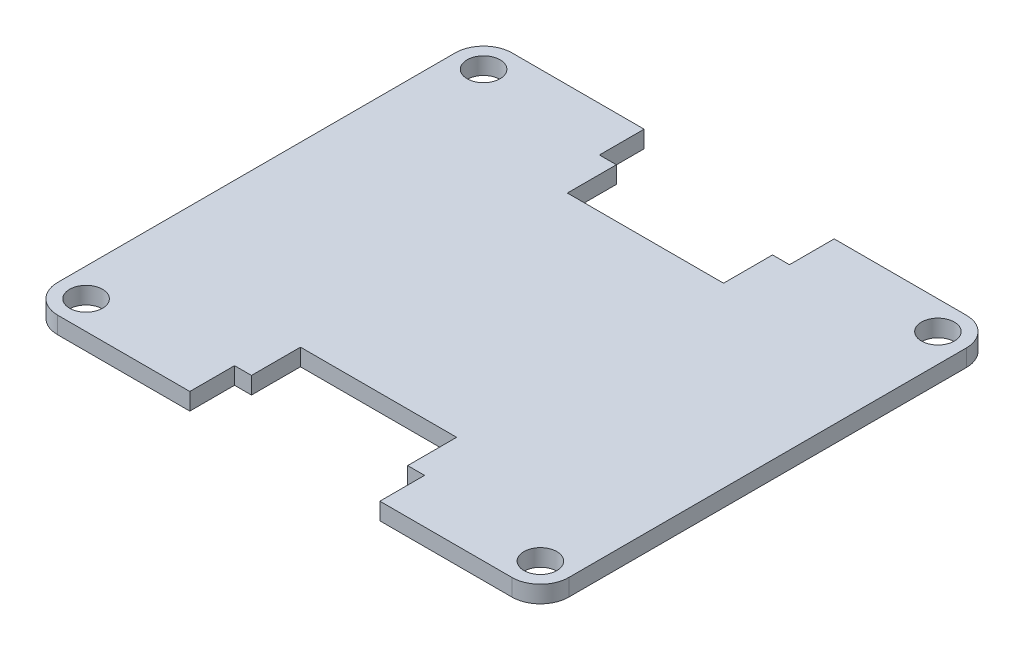
ISO-10303-21;
HEADER;
FILE_DESCRIPTION(('STEP AP214'),'2;1');
FILE_NAME('part.step','',(''),(''),'','','');
FILE_SCHEMA(('AUTOMOTIVE_DESIGN { 1 0 10303 214 1 1 1 1 }'));
ENDSEC;
DATA;
#1=APPLICATION_CONTEXT('core data for automotive mechanical design processes');
#2=APPLICATION_PROTOCOL_DEFINITION('international standard','automotive_design',2000,#1);
#3=PRODUCT_CONTEXT('',#1,'mechanical');
#4=PRODUCT('Part','Part','',(#3));
#5=PRODUCT_RELATED_PRODUCT_CATEGORY('part','',(#4));
#6=PRODUCT_DEFINITION_FORMATION('','',#4);
#7=PRODUCT_DEFINITION_CONTEXT('part definition',#1,'design');
#8=PRODUCT_DEFINITION('design','',#6,#7);
#9=PRODUCT_DEFINITION_SHAPE('','',#8);
#10=(LENGTH_UNIT() NAMED_UNIT(*) SI_UNIT(.MILLI.,.METRE.));
#11=(NAMED_UNIT(*) PLANE_ANGLE_UNIT() SI_UNIT($,.RADIAN.));
#12=(NAMED_UNIT(*) SI_UNIT($,.STERADIAN.) SOLID_ANGLE_UNIT());
#13=UNCERTAINTY_MEASURE_WITH_UNIT(LENGTH_MEASURE(1.E-05),#10,'distance_accuracy_value','');
#14=(GEOMETRIC_REPRESENTATION_CONTEXT(3) GLOBAL_UNCERTAINTY_ASSIGNED_CONTEXT((#13)) GLOBAL_UNIT_ASSIGNED_CONTEXT((#10,
#11,#12)) REPRESENTATION_CONTEXT('',''));
#15=CARTESIAN_POINT('',(0.,0.,0.));
#16=DIRECTION('',(0.,0.,1.));
#17=DIRECTION('',(1.,0.,0.));
#18=AXIS2_PLACEMENT_3D('',#15,#16,#17);
#19=CARTESIAN_POINT('',(-22.86,0.762,20.32));
#20=DIRECTION('',(0.,0.,-1.));
#21=DIRECTION('',(-1.,0.,0.));
#22=AXIS2_PLACEMENT_3D('',#19,#20,#21);
#23=PLANE('',#22);
#24=DIRECTION('',(0.,1.,0.));
#25=VECTOR('',#24,1.);
#26=CARTESIAN_POINT('',(8.5,-0.762,20.32));
#27=LINE('',#26,#25);
#28=CARTESIAN_POINT('',(8.5,-0.762,20.32));
#29=VERTEX_POINT('',#28);
#30=CARTESIAN_POINT('',(8.5,0.762,20.32));
#31=VERTEX_POINT('',#30);
#32=EDGE_CURVE('E277',#29,#31,#27,.T.);
#33=ORIENTED_EDGE('',*,*,#32,.F.);
#34=DIRECTION('',(1.,0.,0.));
#35=VECTOR('',#34,1.);
#36=CARTESIAN_POINT('',(-22.86,-0.762,20.32));
#37=LINE('',#36,#35);
#38=CARTESIAN_POINT('',(20.32,-0.762,20.32));
#39=VERTEX_POINT('',#38);
#40=EDGE_CURVE('E428',#29,#39,#37,.T.);
#41=ORIENTED_EDGE('',*,*,#40,.T.);
#42=DIRECTION('',(0.,-1.,0.));
#43=VECTOR('',#42,1.);
#44=CARTESIAN_POINT('',(20.32,0.762,20.32));
#45=LINE('',#44,#43);
#46=CARTESIAN_POINT('',(20.32,0.762,20.32));
#47=VERTEX_POINT('',#46);
#48=EDGE_CURVE('E11',#39,#47,#45,.F.);
#49=ORIENTED_EDGE('',*,*,#48,.T.);
#50=DIRECTION('',(1.,0.,0.));
#51=VECTOR('',#50,1.);
#52=CARTESIAN_POINT('',(-22.86,0.762,20.32));
#53=LINE('',#52,#51);
#54=EDGE_CURVE('E410',#31,#47,#53,.T.);
#55=ORIENTED_EDGE('',*,*,#54,.F.);
#56=EDGE_LOOP('',(#33,#41,#49,#55));
#57=FACE_BOUND('',#56,.T.);
#58=ADVANCED_FACE('F38',(#57),#23,.F.);
#59=DIRECTION('',(0.,1.,0.));
#60=VECTOR('',#59,1.);
#61=CARTESIAN_POINT('',(-8.5,-0.762,20.32));
#62=LINE('',#61,#60);
#63=CARTESIAN_POINT('',(-8.5,-0.762,20.32));
#64=VERTEX_POINT('',#63);
#65=CARTESIAN_POINT('',(-8.5,0.762,20.32));
#66=VERTEX_POINT('',#65);
#67=EDGE_CURVE('E280',#64,#66,#62,.T.);
#68=ORIENTED_EDGE('',*,*,#67,.T.);
#69=CARTESIAN_POINT('',(-20.32,0.762,20.32));
#70=VERTEX_POINT('',#69);
#71=EDGE_CURVE('E411',#70,#66,#53,.T.);
#72=ORIENTED_EDGE('',*,*,#71,.F.);
#73=DIRECTION('',(0.,-1.,0.));
#74=VECTOR('',#73,1.);
#75=CARTESIAN_POINT('',(-20.32,0.762,20.32));
#76=LINE('',#75,#74);
#77=CARTESIAN_POINT('',(-20.32,-0.762,20.32));
#78=VERTEX_POINT('',#77);
#79=EDGE_CURVE('E47',#70,#78,#76,.T.);
#80=ORIENTED_EDGE('',*,*,#79,.T.);
#81=EDGE_CURVE('E401',#78,#64,#37,.T.);
#82=ORIENTED_EDGE('',*,*,#81,.T.);
#83=EDGE_LOOP('',(#68,#72,#80,#82));
#84=FACE_BOUND('',#83,.T.);
#85=ADVANCED_FACE('F484',(#84),#23,.F.);
#86=CARTESIAN_POINT('',(0.,0.762,0.));
#87=DIRECTION('',(0.,1.,0.));
#88=DIRECTION('',(0.,0.,1.));
#89=AXIS2_PLACEMENT_3D('',#86,#87,#88);
#90=PLANE('',#89);
#91=CARTESIAN_POINT('',(20.32,0.762,-17.78));
#92=DIRECTION('',(0.,1.,0.));
#93=DIRECTION('',(0.,0.,1.));
#94=AXIS2_PLACEMENT_3D('',#91,#92,#93);
#95=CIRCLE('',#94,1.4732);
#96=CARTESIAN_POINT('',(20.32,0.762,-16.3068));
#97=VERTEX_POINT('',#96);
#98=EDGE_CURVE('E342',#97,#97,#95,.T.);
#99=ORIENTED_EDGE('',*,*,#98,.F.);
#100=EDGE_LOOP('',(#99));
#101=FACE_BOUND('',#100,.T.);
#102=CARTESIAN_POINT('',(-20.32,0.762,17.78));
#103=DIRECTION('',(0.,1.,0.));
#104=DIRECTION('',(0.,0.,1.));
#105=AXIS2_PLACEMENT_3D('',#102,#103,#104);
#106=CIRCLE('',#105,1.4732);
#107=CARTESIAN_POINT('',(-20.32,0.762,19.2532));
#108=VERTEX_POINT('',#107);
#109=EDGE_CURVE('E371',#108,#108,#106,.T.);
#110=ORIENTED_EDGE('',*,*,#109,.F.);
#111=EDGE_LOOP('',(#110));
#112=FACE_BOUND('',#111,.T.);
#113=CARTESIAN_POINT('',(-20.32,0.762,-17.78));
#114=DIRECTION('',(0.,1.,0.));
#115=DIRECTION('',(0.,0.,1.));
#116=AXIS2_PLACEMENT_3D('',#113,#114,#115);
#117=CIRCLE('',#116,1.4732);
#118=CARTESIAN_POINT('',(-20.32,0.762,-16.3068));
#119=VERTEX_POINT('',#118);
#120=EDGE_CURVE('E379',#119,#119,#117,.T.);
#121=ORIENTED_EDGE('',*,*,#120,.F.);
#122=EDGE_LOOP('',(#121));
#123=FACE_BOUND('',#122,.T.);
#124=CARTESIAN_POINT('',(20.32,0.762,17.78));
#125=DIRECTION('',(0.,1.,0.));
#126=DIRECTION('',(0.,0.,1.));
#127=AXIS2_PLACEMENT_3D('',#124,#125,#126);
#128=CIRCLE('',#127,1.4732);
#129=CARTESIAN_POINT('',(20.32,0.762,19.2532));
#130=VERTEX_POINT('',#129);
#131=EDGE_CURVE('E387',#130,#130,#128,.T.);
#132=ORIENTED_EDGE('',*,*,#131,.F.);
#133=EDGE_LOOP('',(#132));
#134=FACE_BOUND('',#133,.T.);
#135=DIRECTION('',(1.,0.,0.));
#136=VECTOR('',#135,1.);
#137=CARTESIAN_POINT('',(0.,0.762,16.32));
#138=LINE('',#137,#136);
#139=CARTESIAN_POINT('',(6.985,0.762,16.32));
#140=VERTEX_POINT('',#139);
#141=CARTESIAN_POINT('',(8.5,0.762,16.32));
#142=VERTEX_POINT('',#141);
#143=EDGE_CURVE('E231',#140,#142,#138,.T.);
#144=ORIENTED_EDGE('',*,*,#143,.T.);
#145=DIRECTION('',(0.,0.,1.));
#146=VECTOR('',#145,1.);
#147=CARTESIAN_POINT('',(8.5,0.762,0.));
#148=LINE('',#147,#146);
#149=EDGE_CURVE('E260',#142,#31,#148,.T.);
#150=ORIENTED_EDGE('',*,*,#149,.T.);
#151=ORIENTED_EDGE('',*,*,#54,.T.);
#152=CARTESIAN_POINT('',(20.32,0.762,17.78));
#153=DIRECTION('',(0.,1.,0.));
#154=DIRECTION('',(0.,0.,1.));
#155=AXIS2_PLACEMENT_3D('',#152,#153,#154);
#156=CIRCLE('',#155,2.54);
#157=CARTESIAN_POINT('',(22.86,0.762,17.78));
#158=VERTEX_POINT('',#157);
#159=EDGE_CURVE('E463',#47,#158,#156,.T.);
#160=ORIENTED_EDGE('',*,*,#159,.T.);
#161=DIRECTION('',(0.,0.,-1.));
#162=VECTOR('',#161,1.);
#163=CARTESIAN_POINT('',(22.86,0.762,-20.32));
#164=LINE('',#163,#162);
#165=CARTESIAN_POINT('',(22.86,0.762,-17.78));
#166=VERTEX_POINT('',#165);
#167=EDGE_CURVE('E396',#158,#166,#164,.T.);
#168=ORIENTED_EDGE('',*,*,#167,.T.);
#169=CARTESIAN_POINT('',(20.32,0.762,-17.78));
#170=DIRECTION('',(0.,1.,0.));
#171=DIRECTION('',(0.,0.,1.));
#172=AXIS2_PLACEMENT_3D('',#169,#170,#171);
#173=CIRCLE('',#172,2.54);
#174=CARTESIAN_POINT('',(20.32,0.762,-20.32));
#175=VERTEX_POINT('',#174);
#176=EDGE_CURVE('E469',#166,#175,#173,.T.);
#177=ORIENTED_EDGE('',*,*,#176,.T.);
#178=DIRECTION('',(-1.,0.,0.));
#179=VECTOR('',#178,1.);
#180=CARTESIAN_POINT('',(-22.86,0.762,-20.32));
#181=LINE('',#180,#179);
#182=CARTESIAN_POINT('',(8.5,0.762,-20.32));
#183=VERTEX_POINT('',#182);
#184=EDGE_CURVE('E402',#175,#183,#181,.T.);
#185=ORIENTED_EDGE('',*,*,#184,.T.);
#186=DIRECTION('',(0.,0.,-1.));
#187=VECTOR('',#186,1.);
#188=CARTESIAN_POINT('',(8.5,0.762,0.));
#189=LINE('',#188,#187);
#190=CARTESIAN_POINT('',(8.5,0.762,-16.32));
#191=VERTEX_POINT('',#190);
#192=EDGE_CURVE('E325',#191,#183,#189,.T.);
#193=ORIENTED_EDGE('',*,*,#192,.F.);
#194=DIRECTION('',(1.,0.,0.));
#195=VECTOR('',#194,1.);
#196=CARTESIAN_POINT('',(0.,0.762,-16.32));
#197=LINE('',#196,#195);
#198=CARTESIAN_POINT('',(6.985,0.762,-16.32));
#199=VERTEX_POINT('',#198);
#200=EDGE_CURVE('E321',#199,#191,#197,.T.);
#201=ORIENTED_EDGE('',*,*,#200,.F.);
#202=DIRECTION('',(0.,0.,1.));
#203=VECTOR('',#202,1.);
#204=CARTESIAN_POINT('',(6.985,0.762,0.));
#205=LINE('',#204,#203);
#206=CARTESIAN_POINT('',(6.985,0.762,-11.938));
#207=VERTEX_POINT('',#206);
#208=EDGE_CURVE('E317',#199,#207,#205,.T.);
#209=ORIENTED_EDGE('',*,*,#208,.T.);
#210=DIRECTION('',(-1.,0.,0.));
#211=VECTOR('',#210,1.);
#212=CARTESIAN_POINT('',(0.,0.762,-11.938));
#213=LINE('',#212,#211);
#214=CARTESIAN_POINT('',(-6.985,0.762,-11.938));
#215=VERTEX_POINT('',#214);
#216=EDGE_CURVE('E270',#207,#215,#213,.T.);
#217=ORIENTED_EDGE('',*,*,#216,.T.);
#218=DIRECTION('',(0.,0.,1.));
#219=VECTOR('',#218,1.);
#220=CARTESIAN_POINT('',(-6.985,0.762,0.));
#221=LINE('',#220,#219);
#222=CARTESIAN_POINT('',(-6.985,0.762,-16.32));
#223=VERTEX_POINT('',#222);
#224=EDGE_CURVE('E293',#223,#215,#221,.T.);
#225=ORIENTED_EDGE('',*,*,#224,.F.);
#226=DIRECTION('',(-1.,0.,0.));
#227=VECTOR('',#226,1.);
#228=CARTESIAN_POINT('',(0.,0.762,-16.32));
#229=LINE('',#228,#227);
#230=CARTESIAN_POINT('',(-8.5,0.762,-16.32));
#231=VERTEX_POINT('',#230);
#232=EDGE_CURVE('E332',#223,#231,#229,.T.);
#233=ORIENTED_EDGE('',*,*,#232,.T.);
#234=DIRECTION('',(0.,0.,1.));
#235=VECTOR('',#234,1.);
#236=CARTESIAN_POINT('',(-8.5,0.762,0.));
#237=LINE('',#236,#235);
#238=CARTESIAN_POINT('',(-8.5,0.762,-20.32));
#239=VERTEX_POINT('',#238);
#240=EDGE_CURVE('E328',#239,#231,#237,.T.);
#241=ORIENTED_EDGE('',*,*,#240,.F.);
#242=CARTESIAN_POINT('',(-20.32,0.762,-20.32));
#243=VERTEX_POINT('',#242);
#244=EDGE_CURVE('E400',#239,#243,#181,.T.);
#245=ORIENTED_EDGE('',*,*,#244,.T.);
#246=CARTESIAN_POINT('',(-20.32,0.762,-17.78));
#247=DIRECTION('',(0.,1.,0.));
#248=DIRECTION('',(0.,0.,1.));
#249=AXIS2_PLACEMENT_3D('',#246,#247,#248);
#250=CIRCLE('',#249,2.54);
#251=CARTESIAN_POINT('',(-22.86,0.762,-17.78));
#252=VERTEX_POINT('',#251);
#253=EDGE_CURVE('E466',#243,#252,#250,.T.);
#254=ORIENTED_EDGE('',*,*,#253,.T.);
#255=DIRECTION('',(0.,0.,1.));
#256=VECTOR('',#255,1.);
#257=CARTESIAN_POINT('',(-22.86,0.762,-20.32));
#258=LINE('',#257,#256);
#259=CARTESIAN_POINT('',(-22.86,0.762,17.78));
#260=VERTEX_POINT('',#259);
#261=EDGE_CURVE('E406',#252,#260,#258,.T.);
#262=ORIENTED_EDGE('',*,*,#261,.T.);
#263=CARTESIAN_POINT('',(-20.32,0.762,17.78));
#264=DIRECTION('',(0.,1.,0.));
#265=DIRECTION('',(0.,0.,1.));
#266=AXIS2_PLACEMENT_3D('',#263,#264,#265);
#267=CIRCLE('',#266,2.54);
#268=EDGE_CURVE('E460',#260,#70,#267,.T.);
#269=ORIENTED_EDGE('',*,*,#268,.T.);
#270=ORIENTED_EDGE('',*,*,#71,.T.);
#271=DIRECTION('',(0.,0.,-1.));
#272=VECTOR('',#271,1.);
#273=CARTESIAN_POINT('',(-8.5,0.762,0.));
#274=LINE('',#273,#272);
#275=CARTESIAN_POINT('',(-8.5,0.762,16.32));
#276=VERTEX_POINT('',#275);
#277=EDGE_CURVE('E256',#66,#276,#274,.T.);
#278=ORIENTED_EDGE('',*,*,#277,.T.);
#279=DIRECTION('',(-1.,0.,0.));
#280=VECTOR('',#279,1.);
#281=CARTESIAN_POINT('',(0.,0.762,16.32));
#282=LINE('',#281,#280);
#283=CARTESIAN_POINT('',(-6.985,0.762,16.32));
#284=VERTEX_POINT('',#283);
#285=EDGE_CURVE('E252',#284,#276,#282,.T.);
#286=ORIENTED_EDGE('',*,*,#285,.F.);
#287=DIRECTION('',(0.,0.,-1.));
#288=VECTOR('',#287,1.);
#289=CARTESIAN_POINT('',(-6.985,0.762,0.));
#290=LINE('',#289,#288);
#291=CARTESIAN_POINT('',(-6.985,0.762,11.938));
#292=VERTEX_POINT('',#291);
#293=EDGE_CURVE('E249',#284,#292,#290,.T.);
#294=ORIENTED_EDGE('',*,*,#293,.T.);
#295=DIRECTION('',(-1.,0.,0.));
#296=VECTOR('',#295,1.);
#297=CARTESIAN_POINT('',(0.,0.762,11.938));
#298=LINE('',#297,#296);
#299=CARTESIAN_POINT('',(6.985,0.762,11.938));
#300=VERTEX_POINT('',#299);
#301=EDGE_CURVE('E217',#300,#292,#298,.T.);
#302=ORIENTED_EDGE('',*,*,#301,.F.);
#303=DIRECTION('',(0.,0.,-1.));
#304=VECTOR('',#303,1.);
#305=CARTESIAN_POINT('',(6.985,0.762,0.));
#306=LINE('',#305,#304);
#307=EDGE_CURVE('E227',#140,#300,#306,.T.);
#308=ORIENTED_EDGE('',*,*,#307,.F.);
#309=EDGE_LOOP('',(#144,#150,#151,#160,#168,#177,#185,#193,#201,#209,#217,#225,#233,#241,#245,
#254,#262,#269,#270,#278,#286,#294,#302,#308));
#310=FACE_BOUND('',#309,.T.);
#311=ADVANCED_FACE('F494',(#101,#112,#123,#134,#310),#90,.T.);
#312=CARTESIAN_POINT('',(0.,-0.762,0.));
#313=DIRECTION('',(0.,1.,0.));
#314=DIRECTION('',(0.,0.,1.));
#315=AXIS2_PLACEMENT_3D('',#312,#313,#314);
#316=PLANE('',#315);
#317=CARTESIAN_POINT('',(20.32,-0.762,17.78));
#318=DIRECTION('',(0.,1.,0.));
#319=DIRECTION('',(0.,0.,1.));
#320=AXIS2_PLACEMENT_3D('',#317,#318,#319);
#321=CIRCLE('',#320,1.4732);
#322=CARTESIAN_POINT('',(20.32,-0.762,19.2532));
#323=VERTEX_POINT('',#322);
#324=EDGE_CURVE('E391',#323,#323,#321,.T.);
#325=ORIENTED_EDGE('',*,*,#324,.T.);
#326=EDGE_LOOP('',(#325));
#327=FACE_BOUND('',#326,.T.);
#328=CARTESIAN_POINT('',(-20.32,-0.762,-17.78));
#329=DIRECTION('',(0.,1.,0.));
#330=DIRECTION('',(0.,0.,1.));
#331=AXIS2_PLACEMENT_3D('',#328,#329,#330);
#332=CIRCLE('',#331,1.4732);
#333=CARTESIAN_POINT('',(-20.32,-0.762,-16.3068));
#334=VERTEX_POINT('',#333);
#335=EDGE_CURVE('E383',#334,#334,#332,.T.);
#336=ORIENTED_EDGE('',*,*,#335,.T.);
#337=EDGE_LOOP('',(#336));
#338=FACE_BOUND('',#337,.T.);
#339=CARTESIAN_POINT('',(-20.32,-0.762,17.78));
#340=DIRECTION('',(0.,1.,0.));
#341=DIRECTION('',(0.,0.,1.));
#342=AXIS2_PLACEMENT_3D('',#339,#340,#341);
#343=CIRCLE('',#342,1.4732);
#344=CARTESIAN_POINT('',(-20.32,-0.762,19.2532));
#345=VERTEX_POINT('',#344);
#346=EDGE_CURVE('E375',#345,#345,#343,.T.);
#347=ORIENTED_EDGE('',*,*,#346,.T.);
#348=EDGE_LOOP('',(#347));
#349=FACE_BOUND('',#348,.T.);
#350=CARTESIAN_POINT('',(20.32,-0.762,-17.78));
#351=DIRECTION('',(0.,1.,0.));
#352=DIRECTION('',(0.,0.,1.));
#353=AXIS2_PLACEMENT_3D('',#350,#351,#352);
#354=CIRCLE('',#353,1.4732);
#355=CARTESIAN_POINT('',(20.32,-0.762,-16.3068));
#356=VERTEX_POINT('',#355);
#357=EDGE_CURVE('E367',#356,#356,#354,.T.);
#358=ORIENTED_EDGE('',*,*,#357,.T.);
#359=EDGE_LOOP('',(#358));
#360=FACE_BOUND('',#359,.T.);
#361=DIRECTION('',(0.,0.,1.));
#362=VECTOR('',#361,1.);
#363=CARTESIAN_POINT('',(8.5,-0.762,0.));
#364=LINE('',#363,#362);
#365=CARTESIAN_POINT('',(8.5,-0.762,16.32));
#366=VERTEX_POINT('',#365);
#367=EDGE_CURVE('E239',#366,#29,#364,.T.);
#368=ORIENTED_EDGE('',*,*,#367,.F.);
#369=DIRECTION('',(1.,0.,0.));
#370=VECTOR('',#369,1.);
#371=CARTESIAN_POINT('',(0.,-0.762,16.32));
#372=LINE('',#371,#370);
#373=CARTESIAN_POINT('',(6.985,-0.762,16.32));
#374=VERTEX_POINT('',#373);
#375=EDGE_CURVE('E242',#374,#366,#372,.T.);
#376=ORIENTED_EDGE('',*,*,#375,.F.);
#377=DIRECTION('',(0.,0.,-1.));
#378=VECTOR('',#377,1.);
#379=CARTESIAN_POINT('',(6.985,-0.762,0.));
#380=LINE('',#379,#378);
#381=CARTESIAN_POINT('',(6.985,-0.762,11.938));
#382=VERTEX_POINT('',#381);
#383=EDGE_CURVE('E220',#374,#382,#380,.T.);
#384=ORIENTED_EDGE('',*,*,#383,.T.);
#385=DIRECTION('',(-1.,0.,0.));
#386=VECTOR('',#385,1.);
#387=CARTESIAN_POINT('',(0.,-0.762,11.938));
#388=LINE('',#387,#386);
#389=CARTESIAN_POINT('',(-6.985,-0.762,11.938));
#390=VERTEX_POINT('',#389);
#391=EDGE_CURVE('E210',#382,#390,#388,.T.);
#392=ORIENTED_EDGE('',*,*,#391,.T.);
#393=DIRECTION('',(0.,0.,-1.));
#394=VECTOR('',#393,1.);
#395=CARTESIAN_POINT('',(-6.985,-0.762,0.));
#396=LINE('',#395,#394);
#397=CARTESIAN_POINT('',(-6.985,-0.762,16.32));
#398=VERTEX_POINT('',#397);
#399=EDGE_CURVE('E200',#398,#390,#396,.T.);
#400=ORIENTED_EDGE('',*,*,#399,.F.);
#401=DIRECTION('',(-1.,0.,0.));
#402=VECTOR('',#401,1.);
#403=CARTESIAN_POINT('',(0.,-0.762,16.32));
#404=LINE('',#403,#402);
#405=CARTESIAN_POINT('',(-8.5,-0.762,16.32));
#406=VERTEX_POINT('',#405);
#407=EDGE_CURVE('E54',#398,#406,#404,.T.);
#408=ORIENTED_EDGE('',*,*,#407,.T.);
#409=DIRECTION('',(0.,0.,-1.));
#410=VECTOR('',#409,1.);
#411=CARTESIAN_POINT('',(-8.5,-0.762,0.));
#412=LINE('',#411,#410);
#413=EDGE_CURVE('E236',#64,#406,#412,.T.);
#414=ORIENTED_EDGE('',*,*,#413,.F.);
#415=ORIENTED_EDGE('',*,*,#81,.F.);
#416=CARTESIAN_POINT('',(-20.32,-0.762,17.78));
#417=DIRECTION('',(0.,1.,0.));
#418=DIRECTION('',(0.,0.,1.));
#419=AXIS2_PLACEMENT_3D('',#416,#417,#418);
#420=CIRCLE('',#419,2.54);
#421=CARTESIAN_POINT('',(-22.86,-0.762,17.78));
#422=VERTEX_POINT('',#421);
#423=EDGE_CURVE('E439',#78,#422,#420,.F.);
#424=ORIENTED_EDGE('',*,*,#423,.T.);
#425=DIRECTION('',(0.,0.,1.));
#426=VECTOR('',#425,1.);
#427=CARTESIAN_POINT('',(-22.86,-0.762,-20.32));
#428=LINE('',#427,#426);
#429=CARTESIAN_POINT('',(-22.86,-0.762,-17.78));
#430=VERTEX_POINT('',#429);
#431=EDGE_CURVE('E424',#430,#422,#428,.T.);
#432=ORIENTED_EDGE('',*,*,#431,.F.);
#433=CARTESIAN_POINT('',(-20.32,-0.762,-17.78));
#434=DIRECTION('',(0.,1.,0.));
#435=DIRECTION('',(0.,0.,1.));
#436=AXIS2_PLACEMENT_3D('',#433,#434,#435);
#437=CIRCLE('',#436,2.54);
#438=CARTESIAN_POINT('',(-20.32,-0.762,-20.32));
#439=VERTEX_POINT('',#438);
#440=EDGE_CURVE('E446',#430,#439,#437,.F.);
#441=ORIENTED_EDGE('',*,*,#440,.T.);
#442=DIRECTION('',(-1.,0.,0.));
#443=VECTOR('',#442,1.);
#444=CARTESIAN_POINT('',(-22.86,-0.762,-20.32));
#445=LINE('',#444,#443);
#446=CARTESIAN_POINT('',(-8.5,-0.762,-20.32));
#447=VERTEX_POINT('',#446);
#448=EDGE_CURVE('E419',#447,#439,#445,.T.);
#449=ORIENTED_EDGE('',*,*,#448,.F.);
#450=DIRECTION('',(0.,0.,1.));
#451=VECTOR('',#450,1.);
#452=CARTESIAN_POINT('',(-8.5,-0.762,0.));
#453=LINE('',#452,#451);
#454=CARTESIAN_POINT('',(-8.5,-0.762,-16.32));
#455=VERTEX_POINT('',#454);
#456=EDGE_CURVE('E302',#447,#455,#453,.T.);
#457=ORIENTED_EDGE('',*,*,#456,.T.);
#458=DIRECTION('',(-1.,0.,0.));
#459=VECTOR('',#458,1.);
#460=CARTESIAN_POINT('',(0.,-0.762,-16.32));
#461=LINE('',#460,#459);
#462=CARTESIAN_POINT('',(-6.985,-0.762,-16.32));
#463=VERTEX_POINT('',#462);
#464=EDGE_CURVE('E306',#463,#455,#461,.T.);
#465=ORIENTED_EDGE('',*,*,#464,.F.);
#466=DIRECTION('',(0.,0.,1.));
#467=VECTOR('',#466,1.);
#468=CARTESIAN_POINT('',(-6.985,-0.762,0.));
#469=LINE('',#468,#467);
#470=CARTESIAN_POINT('',(-6.985,-0.762,-11.938));
#471=VERTEX_POINT('',#470);
#472=EDGE_CURVE('E309',#463,#471,#469,.T.);
#473=ORIENTED_EDGE('',*,*,#472,.T.);
#474=DIRECTION('',(-1.,0.,0.));
#475=VECTOR('',#474,1.);
#476=CARTESIAN_POINT('',(0.,-0.762,-11.938));
#477=LINE('',#476,#475);
#478=CARTESIAN_POINT('',(6.985,-0.762,-11.938));
#479=VERTEX_POINT('',#478);
#480=EDGE_CURVE('E289',#479,#471,#477,.T.);
#481=ORIENTED_EDGE('',*,*,#480,.F.);
#482=DIRECTION('',(0.,0.,1.));
#483=VECTOR('',#482,1.);
#484=CARTESIAN_POINT('',(6.985,-0.762,0.));
#485=LINE('',#484,#483);
#486=CARTESIAN_POINT('',(6.985,-0.762,-16.32));
#487=VERTEX_POINT('',#486);
#488=EDGE_CURVE('E292',#487,#479,#485,.T.);
#489=ORIENTED_EDGE('',*,*,#488,.F.);
#490=DIRECTION('',(1.,0.,0.));
#491=VECTOR('',#490,1.);
#492=CARTESIAN_POINT('',(0.,-0.762,-16.32));
#493=LINE('',#492,#491);
#494=CARTESIAN_POINT('',(8.5,-0.762,-16.32));
#495=VERTEX_POINT('',#494);
#496=EDGE_CURVE('E62',#487,#495,#493,.T.);
#497=ORIENTED_EDGE('',*,*,#496,.T.);
#498=DIRECTION('',(0.,0.,-1.));
#499=VECTOR('',#498,1.);
#500=CARTESIAN_POINT('',(8.5,-0.762,0.));
#501=LINE('',#500,#499);
#502=CARTESIAN_POINT('',(8.5,-0.762,-20.32));
#503=VERTEX_POINT('',#502);
#504=EDGE_CURVE('E298',#495,#503,#501,.T.);
#505=ORIENTED_EDGE('',*,*,#504,.T.);
#506=CARTESIAN_POINT('',(20.32,-0.762,-20.32));
#507=VERTEX_POINT('',#506);
#508=EDGE_CURVE('E420',#507,#503,#445,.T.);
#509=ORIENTED_EDGE('',*,*,#508,.F.);
#510=CARTESIAN_POINT('',(20.32,-0.762,-17.78));
#511=DIRECTION('',(0.,1.,0.));
#512=DIRECTION('',(0.,0.,1.));
#513=AXIS2_PLACEMENT_3D('',#510,#511,#512);
#514=CIRCLE('',#513,2.54);
#515=CARTESIAN_POINT('',(22.86,-0.762,-17.78));
#516=VERTEX_POINT('',#515);
#517=EDGE_CURVE('E450',#507,#516,#514,.F.);
#518=ORIENTED_EDGE('',*,*,#517,.T.);
#519=DIRECTION('',(0.,0.,-1.));
#520=VECTOR('',#519,1.);
#521=CARTESIAN_POINT('',(22.86,-0.762,-20.32));
#522=LINE('',#521,#520);
#523=CARTESIAN_POINT('',(22.86,-0.762,17.78));
#524=VERTEX_POINT('',#523);
#525=EDGE_CURVE('E395',#524,#516,#522,.T.);
#526=ORIENTED_EDGE('',*,*,#525,.F.);
#527=CARTESIAN_POINT('',(20.32,-0.762,17.78));
#528=DIRECTION('',(0.,1.,0.));
#529=DIRECTION('',(0.,0.,1.));
#530=AXIS2_PLACEMENT_3D('',#527,#528,#529);
#531=CIRCLE('',#530,2.54);
#532=EDGE_CURVE('E442',#524,#39,#531,.F.);
#533=ORIENTED_EDGE('',*,*,#532,.T.);
#534=ORIENTED_EDGE('',*,*,#40,.F.);
#535=EDGE_LOOP('',(#368,#376,#384,#392,#400,#408,#414,#415,#424,#432,#441,#449,#457,#465,#473,
#481,#489,#497,#505,#509,#518,#526,#533,#534));
#536=FACE_BOUND('',#535,.T.);
#537=ADVANCED_FACE('F223',(#327,#338,#349,#360,#536),#316,.F.);
#538=CARTESIAN_POINT('',(-22.86,0.762,-20.32));
#539=DIRECTION('',(0.,0.,1.));
#540=DIRECTION('',(1.,0.,0.));
#541=AXIS2_PLACEMENT_3D('',#538,#539,#540);
#542=PLANE('',#541);
#543=ORIENTED_EDGE('',*,*,#244,.F.);
#544=DIRECTION('',(0.,1.,0.));
#545=VECTOR('',#544,1.);
#546=CARTESIAN_POINT('',(-8.5,-0.762,-20.32));
#547=LINE('',#546,#545);
#548=EDGE_CURVE('E349',#447,#239,#547,.T.);
#549=ORIENTED_EDGE('',*,*,#548,.F.);
#550=ORIENTED_EDGE('',*,*,#448,.T.);
#551=DIRECTION('',(0.,-1.,0.));
#552=VECTOR('',#551,1.);
#553=CARTESIAN_POINT('',(-20.32,0.762,-20.32));
#554=LINE('',#553,#552);
#555=EDGE_CURVE('E415',#439,#243,#554,.F.);
#556=ORIENTED_EDGE('',*,*,#555,.T.);
#557=EDGE_LOOP('',(#543,#549,#550,#556));
#558=FACE_BOUND('',#557,.T.);
#559=ADVANCED_FACE('F507',(#558),#542,.F.);
#560=CARTESIAN_POINT('',(22.86,0.762,-20.32));
#561=DIRECTION('',(-1.,0.,0.));
#562=DIRECTION('',(0.,0.,1.));
#563=AXIS2_PLACEMENT_3D('',#560,#561,#562);
#564=PLANE('',#563);
#565=ORIENTED_EDGE('',*,*,#525,.T.);
#566=DIRECTION('',(0.,-1.,0.));
#567=VECTOR('',#566,1.);
#568=CARTESIAN_POINT('',(22.86,0.762,-17.78));
#569=LINE('',#568,#567);
#570=EDGE_CURVE('E457',#516,#166,#569,.F.);
#571=ORIENTED_EDGE('',*,*,#570,.T.);
#572=ORIENTED_EDGE('',*,*,#167,.F.);
#573=DIRECTION('',(0.,-1.,0.));
#574=VECTOR('',#573,1.);
#575=CARTESIAN_POINT('',(22.86,0.762,17.78));
#576=LINE('',#575,#574);
#577=EDGE_CURVE('E453',#158,#524,#576,.T.);
#578=ORIENTED_EDGE('',*,*,#577,.T.);
#579=EDGE_LOOP('',(#565,#571,#572,#578));
#580=FACE_BOUND('',#579,.T.);
#581=ADVANCED_FACE('F526',(#580),#564,.F.);
#582=ORIENTED_EDGE('',*,*,#508,.T.);
#583=DIRECTION('',(0.,1.,0.));
#584=VECTOR('',#583,1.);
#585=CARTESIAN_POINT('',(8.5,-0.762,-20.32));
#586=LINE('',#585,#584);
#587=EDGE_CURVE('E352',#503,#183,#586,.T.);
#588=ORIENTED_EDGE('',*,*,#587,.T.);
#589=ORIENTED_EDGE('',*,*,#184,.F.);
#590=DIRECTION('',(0.,-1.,0.));
#591=VECTOR('',#590,1.);
#592=CARTESIAN_POINT('',(20.32,0.762,-20.32));
#593=LINE('',#592,#591);
#594=EDGE_CURVE('E435',#175,#507,#593,.T.);
#595=ORIENTED_EDGE('',*,*,#594,.T.);
#596=EDGE_LOOP('',(#582,#588,#589,#595));
#597=FACE_BOUND('',#596,.T.);
#598=ADVANCED_FACE('F535',(#597),#542,.F.);
#599=CARTESIAN_POINT('',(-22.86,0.762,-20.32));
#600=DIRECTION('',(1.,0.,0.));
#601=DIRECTION('',(0.,0.,-1.));
#602=AXIS2_PLACEMENT_3D('',#599,#600,#601);
#603=PLANE('',#602);
#604=ORIENTED_EDGE('',*,*,#261,.F.);
#605=DIRECTION('',(0.,-1.,0.));
#606=VECTOR('',#605,1.);
#607=CARTESIAN_POINT('',(-22.86,0.762,-17.78));
#608=LINE('',#607,#606);
#609=EDGE_CURVE('E475',#252,#430,#608,.T.);
#610=ORIENTED_EDGE('',*,*,#609,.T.);
#611=ORIENTED_EDGE('',*,*,#431,.T.);
#612=DIRECTION('',(0.,-1.,0.));
#613=VECTOR('',#612,1.);
#614=CARTESIAN_POINT('',(-22.86,0.762,17.78));
#615=LINE('',#614,#613);
#616=EDGE_CURVE('E472',#422,#260,#615,.F.);
#617=ORIENTED_EDGE('',*,*,#616,.T.);
#618=EDGE_LOOP('',(#604,#610,#611,#617));
#619=FACE_BOUND('',#618,.T.);
#620=ADVANCED_FACE('F498',(#619),#603,.F.);
#621=CARTESIAN_POINT('',(20.32,0.762,-17.78));
#622=DIRECTION('',(0.,-1.,0.));
#623=DIRECTION('',(0.,0.,-1.));
#624=AXIS2_PLACEMENT_3D('',#621,#622,#623);
#625=CYLINDRICAL_SURFACE('',#624,2.54);
#626=ORIENTED_EDGE('',*,*,#176,.F.);
#627=ORIENTED_EDGE('',*,*,#570,.F.);
#628=ORIENTED_EDGE('',*,*,#517,.F.);
#629=ORIENTED_EDGE('',*,*,#594,.F.);
#630=EDGE_LOOP('',(#626,#627,#628,#629));
#631=FACE_BOUND('',#630,.T.);
#632=ADVANCED_FACE('F532',(#631),#625,.T.);
#633=CARTESIAN_POINT('',(-20.32,0.762,-17.78));
#634=DIRECTION('',(0.,-1.,0.));
#635=DIRECTION('',(0.,0.,-1.));
#636=AXIS2_PLACEMENT_3D('',#633,#634,#635);
#637=CYLINDRICAL_SURFACE('',#636,2.54);
#638=ORIENTED_EDGE('',*,*,#253,.F.);
#639=ORIENTED_EDGE('',*,*,#555,.F.);
#640=ORIENTED_EDGE('',*,*,#440,.F.);
#641=ORIENTED_EDGE('',*,*,#609,.F.);
#642=EDGE_LOOP('',(#638,#639,#640,#641));
#643=FACE_BOUND('',#642,.T.);
#644=ADVANCED_FACE('F504',(#643),#637,.T.);
#645=CARTESIAN_POINT('',(20.32,0.762,17.78));
#646=DIRECTION('',(0.,-1.,0.));
#647=DIRECTION('',(0.,0.,-1.));
#648=AXIS2_PLACEMENT_3D('',#645,#646,#647);
#649=CYLINDRICAL_SURFACE('',#648,2.54);
#650=ORIENTED_EDGE('',*,*,#159,.F.);
#651=ORIENTED_EDGE('',*,*,#48,.F.);
#652=ORIENTED_EDGE('',*,*,#532,.F.);
#653=ORIENTED_EDGE('',*,*,#577,.F.);
#654=EDGE_LOOP('',(#650,#651,#652,#653));
#655=FACE_BOUND('',#654,.T.);
#656=ADVANCED_FACE('F523',(#655),#649,.T.);
#657=CARTESIAN_POINT('',(-20.32,0.762,17.78));
#658=DIRECTION('',(0.,-1.,0.));
#659=DIRECTION('',(0.,0.,-1.));
#660=AXIS2_PLACEMENT_3D('',#657,#658,#659);
#661=CYLINDRICAL_SURFACE('',#660,2.54);
#662=ORIENTED_EDGE('',*,*,#268,.F.);
#663=ORIENTED_EDGE('',*,*,#616,.F.);
#664=ORIENTED_EDGE('',*,*,#423,.F.);
#665=ORIENTED_EDGE('',*,*,#79,.F.);
#666=EDGE_LOOP('',(#662,#663,#664,#665));
#667=FACE_BOUND('',#666,.T.);
#668=ADVANCED_FACE('F40',(#667),#661,.T.);
#669=CARTESIAN_POINT('',(20.32,0.762,17.78));
#670=DIRECTION('',(0.,1.,0.));
#671=DIRECTION('',(0.,0.,1.));
#672=AXIS2_PLACEMENT_3D('',#669,#670,#671);
#673=CYLINDRICAL_SURFACE('',#672,1.4732);
#674=ORIENTED_EDGE('',*,*,#324,.F.);
#675=EDGE_LOOP('',(#674));
#676=FACE_BOUND('',#675,.T.);
#677=ORIENTED_EDGE('',*,*,#131,.T.);
#678=EDGE_LOOP('',(#677));
#679=FACE_BOUND('',#678,.T.);
#680=ADVANCED_FACE('F594',(#676,#679),#673,.F.);
#681=CARTESIAN_POINT('',(-20.32,0.762,-17.78));
#682=DIRECTION('',(0.,1.,0.));
#683=DIRECTION('',(0.,0.,1.));
#684=AXIS2_PLACEMENT_3D('',#681,#682,#683);
#685=CYLINDRICAL_SURFACE('',#684,1.4732);
#686=ORIENTED_EDGE('',*,*,#335,.F.);
#687=EDGE_LOOP('',(#686));
#688=FACE_BOUND('',#687,.T.);
#689=ORIENTED_EDGE('',*,*,#120,.T.);
#690=EDGE_LOOP('',(#689));
#691=FACE_BOUND('',#690,.T.);
#692=ADVANCED_FACE('F598',(#688,#691),#685,.F.);
#693=CARTESIAN_POINT('',(-20.32,0.762,17.78));
#694=DIRECTION('',(0.,1.,0.));
#695=DIRECTION('',(0.,0.,1.));
#696=AXIS2_PLACEMENT_3D('',#693,#694,#695);
#697=CYLINDRICAL_SURFACE('',#696,1.4732);
#698=ORIENTED_EDGE('',*,*,#346,.F.);
#699=EDGE_LOOP('',(#698));
#700=FACE_BOUND('',#699,.T.);
#701=ORIENTED_EDGE('',*,*,#109,.T.);
#702=EDGE_LOOP('',(#701));
#703=FACE_BOUND('',#702,.T.);
#704=ADVANCED_FACE('F604',(#700,#703),#697,.F.);
#705=CARTESIAN_POINT('',(20.32,0.762,-17.78));
#706=DIRECTION('',(0.,1.,0.));
#707=DIRECTION('',(0.,0.,1.));
#708=AXIS2_PLACEMENT_3D('',#705,#706,#707);
#709=CYLINDRICAL_SURFACE('',#708,1.4732);
#710=ORIENTED_EDGE('',*,*,#357,.F.);
#711=EDGE_LOOP('',(#710));
#712=FACE_BOUND('',#711,.T.);
#713=ORIENTED_EDGE('',*,*,#98,.T.);
#714=EDGE_LOOP('',(#713));
#715=FACE_BOUND('',#714,.T.);
#716=ADVANCED_FACE('F626',(#712,#715),#709,.F.);
#717=CARTESIAN_POINT('',(0.,-0.762,-11.938));
#718=DIRECTION('',(0.,0.,-1.));
#719=DIRECTION('',(-1.,0.,0.));
#720=AXIS2_PLACEMENT_3D('',#717,#718,#719);
#721=PLANE('',#720);
#722=ORIENTED_EDGE('',*,*,#216,.F.);
#723=DIRECTION('',(0.,1.,0.));
#724=VECTOR('',#723,1.);
#725=CARTESIAN_POINT('',(6.985,-0.762,-11.938));
#726=LINE('',#725,#724);
#727=EDGE_CURVE('E313',#479,#207,#726,.T.);
#728=ORIENTED_EDGE('',*,*,#727,.F.);
#729=ORIENTED_EDGE('',*,*,#480,.T.);
#730=DIRECTION('',(0.,1.,0.));
#731=VECTOR('',#730,1.);
#732=CARTESIAN_POINT('',(-6.985,-0.762,-11.938));
#733=LINE('',#732,#731);
#734=EDGE_CURVE('E339',#471,#215,#733,.T.);
#735=ORIENTED_EDGE('',*,*,#734,.T.);
#736=EDGE_LOOP('',(#722,#728,#729,#735));
#737=FACE_BOUND('',#736,.T.);
#738=ADVANCED_FACE('F550',(#737),#721,.T.);
#739=CARTESIAN_POINT('',(-6.985,-0.762,0.));
#740=DIRECTION('',(-1.,0.,0.));
#741=DIRECTION('',(0.,0.,1.));
#742=AXIS2_PLACEMENT_3D('',#739,#740,#741);
#743=PLANE('',#742);
#744=ORIENTED_EDGE('',*,*,#224,.T.);
#745=ORIENTED_EDGE('',*,*,#734,.F.);
#746=ORIENTED_EDGE('',*,*,#472,.F.);
#747=DIRECTION('',(0.,1.,0.));
#748=VECTOR('',#747,1.);
#749=CARTESIAN_POINT('',(-6.985,-0.762,-16.32));
#750=LINE('',#749,#748);
#751=EDGE_CURVE('E343',#463,#223,#750,.T.);
#752=ORIENTED_EDGE('',*,*,#751,.T.);
#753=EDGE_LOOP('',(#744,#745,#746,#752));
#754=FACE_BOUND('',#753,.T.);
#755=ADVANCED_FACE('F555',(#754),#743,.F.);
#756=CARTESIAN_POINT('',(0.,-0.762,-16.32));
#757=DIRECTION('',(0.,0.,-1.));
#758=DIRECTION('',(-1.,0.,0.));
#759=AXIS2_PLACEMENT_3D('',#756,#757,#758);
#760=PLANE('',#759);
#761=ORIENTED_EDGE('',*,*,#232,.F.);
#762=ORIENTED_EDGE('',*,*,#751,.F.);
#763=ORIENTED_EDGE('',*,*,#464,.T.);
#764=DIRECTION('',(0.,1.,0.));
#765=VECTOR('',#764,1.);
#766=CARTESIAN_POINT('',(-8.5,-0.762,-16.32));
#767=LINE('',#766,#765);
#768=EDGE_CURVE('E346',#455,#231,#767,.T.);
#769=ORIENTED_EDGE('',*,*,#768,.T.);
#770=EDGE_LOOP('',(#761,#762,#763,#769));
#771=FACE_BOUND('',#770,.T.);
#772=ADVANCED_FACE('F559',(#771),#760,.T.);
#773=CARTESIAN_POINT('',(-8.5,-0.762,0.));
#774=DIRECTION('',(-1.,0.,0.));
#775=DIRECTION('',(0.,0.,1.));
#776=AXIS2_PLACEMENT_3D('',#773,#774,#775);
#777=PLANE('',#776);
#778=ORIENTED_EDGE('',*,*,#240,.T.);
#779=ORIENTED_EDGE('',*,*,#768,.F.);
#780=ORIENTED_EDGE('',*,*,#456,.F.);
#781=ORIENTED_EDGE('',*,*,#548,.T.);
#782=EDGE_LOOP('',(#778,#779,#780,#781));
#783=FACE_BOUND('',#782,.T.);
#784=ADVANCED_FACE('F563',(#783),#777,.F.);
#785=CARTESIAN_POINT('',(8.5,-0.762,0.));
#786=DIRECTION('',(1.,0.,0.));
#787=DIRECTION('',(0.,0.,-1.));
#788=AXIS2_PLACEMENT_3D('',#785,#786,#787);
#789=PLANE('',#788);
#790=ORIENTED_EDGE('',*,*,#192,.T.);
#791=ORIENTED_EDGE('',*,*,#587,.F.);
#792=ORIENTED_EDGE('',*,*,#504,.F.);
#793=DIRECTION('',(0.,1.,0.));
#794=VECTOR('',#793,1.);
#795=CARTESIAN_POINT('',(8.5,-0.762,-16.32));
#796=LINE('',#795,#794);
#797=EDGE_CURVE('E356',#495,#191,#796,.T.);
#798=ORIENTED_EDGE('',*,*,#797,.T.);
#799=EDGE_LOOP('',(#790,#791,#792,#798));
#800=FACE_BOUND('',#799,.T.);
#801=ADVANCED_FACE('F539',(#800),#789,.F.);
#802=CARTESIAN_POINT('',(0.,-0.762,-16.32));
#803=DIRECTION('',(0.,0.,1.));
#804=DIRECTION('',(1.,0.,0.));
#805=AXIS2_PLACEMENT_3D('',#802,#803,#804);
#806=PLANE('',#805);
#807=ORIENTED_EDGE('',*,*,#200,.T.);
#808=ORIENTED_EDGE('',*,*,#797,.F.);
#809=ORIENTED_EDGE('',*,*,#496,.F.);
#810=DIRECTION('',(0.,1.,0.));
#811=VECTOR('',#810,1.);
#812=CARTESIAN_POINT('',(6.985,-0.762,-16.32));
#813=LINE('',#812,#811);
#814=EDGE_CURVE('E359',#487,#199,#813,.T.);
#815=ORIENTED_EDGE('',*,*,#814,.T.);
#816=EDGE_LOOP('',(#807,#808,#809,#815));
#817=FACE_BOUND('',#816,.T.);
#818=ADVANCED_FACE('F541',(#817),#806,.F.);
#819=CARTESIAN_POINT('',(6.985,-0.762,0.));
#820=DIRECTION('',(-1.,0.,0.));
#821=DIRECTION('',(0.,0.,1.));
#822=AXIS2_PLACEMENT_3D('',#819,#820,#821);
#823=PLANE('',#822);
#824=ORIENTED_EDGE('',*,*,#208,.F.);
#825=ORIENTED_EDGE('',*,*,#814,.F.);
#826=ORIENTED_EDGE('',*,*,#488,.T.);
#827=ORIENTED_EDGE('',*,*,#727,.T.);
#828=EDGE_LOOP('',(#824,#825,#826,#827));
#829=FACE_BOUND('',#828,.T.);
#830=ADVANCED_FACE('F545',(#829),#823,.T.);
#831=CARTESIAN_POINT('',(0.,-0.762,11.938));
#832=DIRECTION('',(0.,0.,-1.));
#833=DIRECTION('',(-1.,0.,0.));
#834=AXIS2_PLACEMENT_3D('',#831,#832,#833);
#835=PLANE('',#834);
#836=ORIENTED_EDGE('',*,*,#301,.T.);
#837=DIRECTION('',(0.,1.,0.));
#838=VECTOR('',#837,1.);
#839=CARTESIAN_POINT('',(-6.985,-0.762,11.938));
#840=LINE('',#839,#838);
#841=EDGE_CURVE('E204',#390,#292,#840,.T.);
#842=ORIENTED_EDGE('',*,*,#841,.F.);
#843=ORIENTED_EDGE('',*,*,#391,.F.);
#844=DIRECTION('',(0.,1.,0.));
#845=VECTOR('',#844,1.);
#846=CARTESIAN_POINT('',(6.985,-0.762,11.938));
#847=LINE('',#846,#845);
#848=EDGE_CURVE('E267',#382,#300,#847,.T.);
#849=ORIENTED_EDGE('',*,*,#848,.T.);
#850=EDGE_LOOP('',(#836,#842,#843,#849));
#851=FACE_BOUND('',#850,.T.);
#852=ADVANCED_FACE('F214',(#851),#835,.F.);
#853=CARTESIAN_POINT('',(6.985,-0.762,0.));
#854=DIRECTION('',(1.,0.,0.));
#855=DIRECTION('',(0.,0.,-1.));
#856=AXIS2_PLACEMENT_3D('',#853,#854,#855);
#857=PLANE('',#856);
#858=ORIENTED_EDGE('',*,*,#307,.T.);
#859=ORIENTED_EDGE('',*,*,#848,.F.);
#860=ORIENTED_EDGE('',*,*,#383,.F.);
#861=DIRECTION('',(0.,1.,0.));
#862=VECTOR('',#861,1.);
#863=CARTESIAN_POINT('',(6.985,-0.762,16.32));
#864=LINE('',#863,#862);
#865=EDGE_CURVE('E271',#374,#140,#864,.T.);
#866=ORIENTED_EDGE('',*,*,#865,.T.);
#867=EDGE_LOOP('',(#858,#859,#860,#866));
#868=FACE_BOUND('',#867,.T.);
#869=ADVANCED_FACE('F653',(#868),#857,.F.);
#870=CARTESIAN_POINT('',(0.,-0.762,16.32));
#871=DIRECTION('',(0.,0.,1.));
#872=DIRECTION('',(1.,0.,0.));
#873=AXIS2_PLACEMENT_3D('',#870,#871,#872);
#874=PLANE('',#873);
#875=ORIENTED_EDGE('',*,*,#143,.F.);
#876=ORIENTED_EDGE('',*,*,#865,.F.);
#877=ORIENTED_EDGE('',*,*,#375,.T.);
#878=DIRECTION('',(0.,1.,0.));
#879=VECTOR('',#878,1.);
#880=CARTESIAN_POINT('',(8.5,-0.762,16.32));
#881=LINE('',#880,#879);
#882=EDGE_CURVE('E274',#366,#142,#881,.T.);
#883=ORIENTED_EDGE('',*,*,#882,.T.);
#884=EDGE_LOOP('',(#875,#876,#877,#883));
#885=FACE_BOUND('',#884,.T.);
#886=ADVANCED_FACE('F660',(#885),#874,.T.);
#887=CARTESIAN_POINT('',(8.5,-0.762,0.));
#888=DIRECTION('',(-1.,0.,0.));
#889=DIRECTION('',(0.,0.,1.));
#890=AXIS2_PLACEMENT_3D('',#887,#888,#889);
#891=PLANE('',#890);
#892=ORIENTED_EDGE('',*,*,#149,.F.);
#893=ORIENTED_EDGE('',*,*,#882,.F.);
#894=ORIENTED_EDGE('',*,*,#367,.T.);
#895=ORIENTED_EDGE('',*,*,#32,.T.);
#896=EDGE_LOOP('',(#892,#893,#894,#895));
#897=FACE_BOUND('',#896,.T.);
#898=ADVANCED_FACE('F668',(#897),#891,.T.);
#899=CARTESIAN_POINT('',(-8.5,-0.762,0.));
#900=DIRECTION('',(1.,0.,0.));
#901=DIRECTION('',(0.,0.,-1.));
#902=AXIS2_PLACEMENT_3D('',#899,#900,#901);
#903=PLANE('',#902);
#904=ORIENTED_EDGE('',*,*,#277,.F.);
#905=ORIENTED_EDGE('',*,*,#67,.F.);
#906=ORIENTED_EDGE('',*,*,#413,.T.);
#907=DIRECTION('',(0.,1.,0.));
#908=VECTOR('',#907,1.);
#909=CARTESIAN_POINT('',(-8.5,-0.762,16.32));
#910=LINE('',#909,#908);
#911=EDGE_CURVE('E284',#406,#276,#910,.T.);
#912=ORIENTED_EDGE('',*,*,#911,.T.);
#913=EDGE_LOOP('',(#904,#905,#906,#912));
#914=FACE_BOUND('',#913,.T.);
#915=ADVANCED_FACE('F490',(#914),#903,.T.);
#916=CARTESIAN_POINT('',(0.,-0.762,16.32));
#917=DIRECTION('',(0.,0.,-1.));
#918=DIRECTION('',(-1.,0.,0.));
#919=AXIS2_PLACEMENT_3D('',#916,#917,#918);
#920=PLANE('',#919);
#921=ORIENTED_EDGE('',*,*,#285,.T.);
#922=ORIENTED_EDGE('',*,*,#911,.F.);
#923=ORIENTED_EDGE('',*,*,#407,.F.);
#924=DIRECTION('',(0.,1.,0.));
#925=VECTOR('',#924,1.);
#926=CARTESIAN_POINT('',(-6.985,-0.762,16.32));
#927=LINE('',#926,#925);
#928=EDGE_CURVE('E206',#398,#284,#927,.T.);
#929=ORIENTED_EDGE('',*,*,#928,.T.);
#930=EDGE_LOOP('',(#921,#922,#923,#929));
#931=FACE_BOUND('',#930,.T.);
#932=ADVANCED_FACE('F491',(#931),#920,.F.);
#933=CARTESIAN_POINT('',(-6.985,-0.762,0.));
#934=DIRECTION('',(1.,0.,0.));
#935=DIRECTION('',(0.,0.,-1.));
#936=AXIS2_PLACEMENT_3D('',#933,#934,#935);
#937=PLANE('',#936);
#938=ORIENTED_EDGE('',*,*,#293,.F.);
#939=ORIENTED_EDGE('',*,*,#928,.F.);
#940=ORIENTED_EDGE('',*,*,#399,.T.);
#941=ORIENTED_EDGE('',*,*,#841,.T.);
#942=EDGE_LOOP('',(#938,#939,#940,#941));
#943=FACE_BOUND('',#942,.T.);
#944=ADVANCED_FACE('F203',(#943),#937,.T.);
#945=CLOSED_SHELL('',(#58,#85,#311,#537,#559,#581,#598,#620,#632,#644,#656,#668,#680,#692,#704,
#716,#738,#755,#772,#784,#801,#818,#830,#852,#869,#886,#898,#915,#932,#944));
#946=MANIFOLD_SOLID_BREP('B2',#945);
#947=ADVANCED_BREP_SHAPE_REPRESENTATION('',(#18,#946),#14);
#948=SHAPE_DEFINITION_REPRESENTATION(#9,#947);
ENDSEC;
END-ISO-10303-21;
